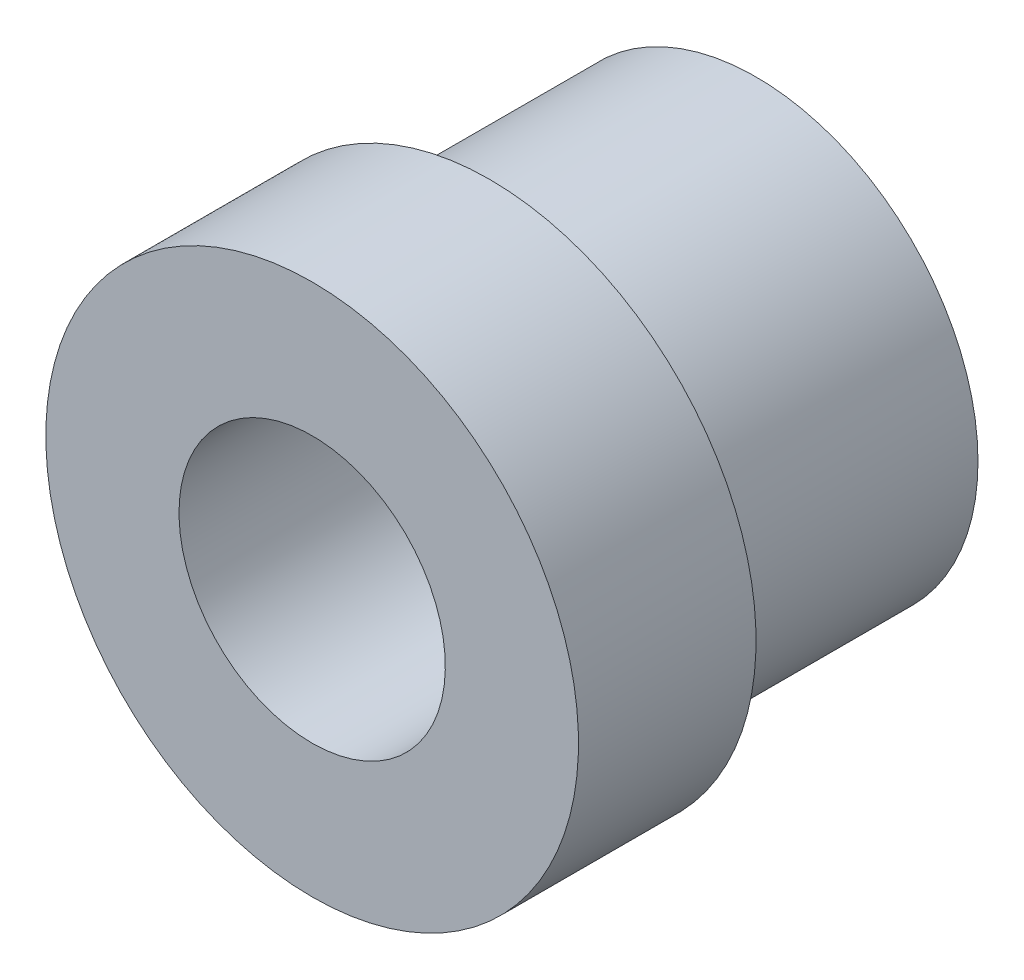
ISO-10303-21;
HEADER;
FILE_DESCRIPTION(('STEP AP214'),'2;1');
FILE_NAME('part.step','',(''),(''),'','','');
FILE_SCHEMA(('AUTOMOTIVE_DESIGN { 1 0 10303 214 1 1 1 1 }'));
ENDSEC;
DATA;
#1=APPLICATION_CONTEXT('core data for automotive mechanical design processes');
#2=APPLICATION_PROTOCOL_DEFINITION('international standard','automotive_design',2000,#1);
#3=PRODUCT_CONTEXT('',#1,'mechanical');
#4=PRODUCT('Part','Part','',(#3));
#5=PRODUCT_RELATED_PRODUCT_CATEGORY('part','',(#4));
#6=PRODUCT_DEFINITION_FORMATION('','',#4);
#7=PRODUCT_DEFINITION_CONTEXT('part definition',#1,'design');
#8=PRODUCT_DEFINITION('design','',#6,#7);
#9=PRODUCT_DEFINITION_SHAPE('','',#8);
#10=(LENGTH_UNIT() NAMED_UNIT(*) SI_UNIT(.MILLI.,.METRE.));
#11=(NAMED_UNIT(*) PLANE_ANGLE_UNIT() SI_UNIT($,.RADIAN.));
#12=(NAMED_UNIT(*) SI_UNIT($,.STERADIAN.) SOLID_ANGLE_UNIT());
#13=UNCERTAINTY_MEASURE_WITH_UNIT(LENGTH_MEASURE(1.E-05),#10,'distance_accuracy_value','');
#14=(GEOMETRIC_REPRESENTATION_CONTEXT(3) GLOBAL_UNCERTAINTY_ASSIGNED_CONTEXT((#13)) GLOBAL_UNIT_ASSIGNED_CONTEXT((#10,
#11,#12)) REPRESENTATION_CONTEXT('',''));
#15=CARTESIAN_POINT('',(0.,0.,0.));
#16=DIRECTION('',(0.,0.,1.));
#17=DIRECTION('',(1.,0.,0.));
#18=AXIS2_PLACEMENT_3D('',#15,#16,#17);
#19=CARTESIAN_POINT('',(0.,0.,-36.4449652892562));
#20=DIRECTION('',(0.,0.,-1.));
#21=DIRECTION('',(-1.,0.,0.));
#22=AXIS2_PLACEMENT_3D('',#19,#20,#21);
#23=CONICAL_SURFACE('',#22,7.5,0.785398163397448);
#24=CARTESIAN_POINT('',(0.,0.,-36.4449652892562));
#25=DIRECTION('',(0.,0.,1.));
#26=DIRECTION('',(0.,-1.,0.));
#27=AXIS2_PLACEMENT_3D('',#24,#25,#26);
#28=CIRCLE('',#27,7.5);
#29=CARTESIAN_POINT('',(0.,-7.5,-36.4449652892562));
#30=VERTEX_POINT('',#29);
#31=EDGE_CURVE('E30',#30,#30,#28,.F.);
#32=ORIENTED_EDGE('',*,*,#31,.F.);
#33=EDGE_LOOP('',(#32));
#34=FACE_BOUND('',#33,.T.);
#35=CARTESIAN_POINT('',(0.,0.,-35.4449652892562));
#36=DIRECTION('',(0.,0.,-1.));
#37=DIRECTION('',(-1.,0.,0.));
#38=AXIS2_PLACEMENT_3D('',#35,#36,#37);
#39=CIRCLE('',#38,6.5);
#40=CARTESIAN_POINT('',(-6.5,0.,-35.4449652892562));
#41=VERTEX_POINT('',#40);
#42=EDGE_CURVE('E18',#41,#41,#39,.T.);
#43=ORIENTED_EDGE('',*,*,#42,.T.);
#44=EDGE_LOOP('',(#43));
#45=FACE_BOUND('',#44,.T.);
#46=ADVANCED_FACE('F15',(#34,#45),#23,.T.);
#47=CARTESIAN_POINT('',(0.,9.,-35.4449652892562));
#48=DIRECTION('',(0.,0.,1.));
#49=DIRECTION('',(0.,-1.,0.));
#50=AXIS2_PLACEMENT_3D('',#47,#48,#49);
#51=PLANE('',#50);
#52=ORIENTED_EDGE('',*,*,#42,.F.);
#53=EDGE_LOOP('',(#52));
#54=FACE_BOUND('',#53,.T.);
#55=CARTESIAN_POINT('',(0.,0.,-35.4449652892562));
#56=DIRECTION('',(0.,0.,1.));
#57=DIRECTION('',(0.,-1.,0.));
#58=AXIS2_PLACEMENT_3D('',#55,#56,#57);
#59=CIRCLE('',#58,9.);
#60=CARTESIAN_POINT('',(0.,-9.,-35.4449652892562));
#61=VERTEX_POINT('',#60);
#62=EDGE_CURVE('E38',#61,#61,#59,.T.);
#63=ORIENTED_EDGE('',*,*,#62,.F.);
#64=EDGE_LOOP('',(#63));
#65=FACE_BOUND('',#64,.T.);
#66=ADVANCED_FACE('F50',(#54,#65),#51,.F.);
#67=CARTESIAN_POINT('',(0.,0.,-29.4449652892562));
#68=DIRECTION('',(0.,0.,1.));
#69=DIRECTION('',(0.,-1.,0.));
#70=AXIS2_PLACEMENT_3D('',#67,#68,#69);
#71=CYLINDRICAL_SURFACE('',#70,7.5);
#72=ORIENTED_EDGE('',*,*,#31,.T.);
#73=EDGE_LOOP('',(#72));
#74=FACE_BOUND('',#73,.T.);
#75=CARTESIAN_POINT('',(0.,0.,-44.4449652892729));
#76=DIRECTION('',(0.,0.,1.));
#77=DIRECTION('',(0.,-1.,0.));
#78=AXIS2_PLACEMENT_3D('',#75,#76,#77);
#79=CIRCLE('',#78,7.50000000005002);
#80=CARTESIAN_POINT('',(0.,-7.50000000005002,-44.4449652892729));
#81=VERTEX_POINT('',#80);
#82=EDGE_CURVE('E37',#81,#81,#79,.F.);
#83=ORIENTED_EDGE('',*,*,#82,.F.);
#84=EDGE_LOOP('',(#83));
#85=FACE_BOUND('',#84,.T.);
#86=ADVANCED_FACE('F53',(#74,#85),#71,.T.);
#87=CARTESIAN_POINT('',(0.,0.,-29.4449652892562));
#88=DIRECTION('',(0.,0.,1.));
#89=DIRECTION('',(0.,-1.,0.));
#90=AXIS2_PLACEMENT_3D('',#87,#88,#89);
#91=CYLINDRICAL_SURFACE('',#90,9.);
#92=CARTESIAN_POINT('',(0.,0.,-29.4449652892562));
#93=DIRECTION('',(0.,0.,1.));
#94=DIRECTION('',(0.,-1.,0.));
#95=AXIS2_PLACEMENT_3D('',#92,#93,#94);
#96=CIRCLE('',#95,9.);
#97=CARTESIAN_POINT('',(0.,-9.,-29.4449652892562));
#98=VERTEX_POINT('',#97);
#99=EDGE_CURVE('E35',#98,#98,#96,.F.);
#100=ORIENTED_EDGE('',*,*,#99,.T.);
#101=EDGE_LOOP('',(#100));
#102=FACE_BOUND('',#101,.T.);
#103=ORIENTED_EDGE('',*,*,#62,.T.);
#104=EDGE_LOOP('',(#103));
#105=FACE_BOUND('',#104,.T.);
#106=ADVANCED_FACE('F59',(#102,#105),#91,.T.);
#107=CARTESIAN_POINT('',(0.,0.,-44.4449652892729));
#108=DIRECTION('',(0.,0.,1.));
#109=DIRECTION('',(1.,0.,0.));
#110=AXIS2_PLACEMENT_3D('',#107,#108,#109);
#111=CONICAL_SURFACE('',#110,7.50000000005002,1.21449651636134);
#112=ORIENTED_EDGE('',*,*,#82,.T.);
#113=EDGE_LOOP('',(#112));
#114=FACE_BOUND('',#113,.T.);
#115=CARTESIAN_POINT('',(0.,0.,-45.4449652892777));
#116=DIRECTION('',(0.,0.,1.));
#117=DIRECTION('',(1.,0.,0.));
#118=AXIS2_PLACEMENT_3D('',#115,#116,#117);
#119=CIRCLE('',#118,4.81315894541012);
#120=CARTESIAN_POINT('',(4.81315894541012,0.,-45.4449652892777));
#121=VERTEX_POINT('',#120);
#122=EDGE_CURVE('E27',#121,#121,#119,.T.);
#123=ORIENTED_EDGE('',*,*,#122,.T.);
#124=EDGE_LOOP('',(#123));
#125=FACE_BOUND('',#124,.T.);
#126=ADVANCED_FACE('F77',(#114,#125),#111,.T.);
#127=CARTESIAN_POINT('',(0.,4.5,-29.4449652892562));
#128=DIRECTION('',(0.,0.,-1.));
#129=DIRECTION('',(0.,1.,0.));
#130=AXIS2_PLACEMENT_3D('',#127,#128,#129);
#131=PLANE('',#130);
#132=ORIENTED_EDGE('',*,*,#99,.F.);
#133=EDGE_LOOP('',(#132));
#134=FACE_BOUND('',#133,.T.);
#135=CARTESIAN_POINT('',(0.,0.,-29.4449652892562));
#136=DIRECTION('',(0.,0.,1.));
#137=DIRECTION('',(0.,-1.,0.));
#138=AXIS2_PLACEMENT_3D('',#135,#136,#137);
#139=CIRCLE('',#138,4.5);
#140=CARTESIAN_POINT('',(0.,-4.5,-29.4449652892562));
#141=VERTEX_POINT('',#140);
#142=EDGE_CURVE('E22',#141,#141,#139,.F.);
#143=ORIENTED_EDGE('',*,*,#142,.T.);
#144=EDGE_LOOP('',(#143));
#145=FACE_BOUND('',#144,.T.);
#146=ADVANCED_FACE('F70',(#134,#145),#131,.F.);
#147=CARTESIAN_POINT('',(0.,4.8131589454171,-45.4449652892562));
#148=DIRECTION('',(0.,0.,1.));
#149=DIRECTION('',(0.,-1.,0.));
#150=AXIS2_PLACEMENT_3D('',#147,#148,#149);
#151=PLANE('',#150);
#152=CARTESIAN_POINT('',(0.,0.,-45.4449652892562));
#153=DIRECTION('',(0.,0.,1.));
#154=DIRECTION('',(0.,-1.,0.));
#155=AXIS2_PLACEMENT_3D('',#152,#153,#154);
#156=CIRCLE('',#155,4.5);
#157=CARTESIAN_POINT('',(0.,-4.5,-45.4449652892562));
#158=VERTEX_POINT('',#157);
#159=EDGE_CURVE('E10',#158,#158,#156,.T.);
#160=ORIENTED_EDGE('',*,*,#159,.T.);
#161=EDGE_LOOP('',(#160));
#162=FACE_BOUND('',#161,.T.);
#163=ORIENTED_EDGE('',*,*,#122,.F.);
#164=EDGE_LOOP('',(#163));
#165=FACE_BOUND('',#164,.T.);
#166=ADVANCED_FACE('F64',(#162,#165),#151,.F.);
#167=CARTESIAN_POINT('',(0.,0.,-29.4449652892562));
#168=DIRECTION('',(0.,0.,1.));
#169=DIRECTION('',(0.,-1.,0.));
#170=AXIS2_PLACEMENT_3D('',#167,#168,#169);
#171=CYLINDRICAL_SURFACE('',#170,4.5);
#172=ORIENTED_EDGE('',*,*,#142,.F.);
#173=EDGE_LOOP('',(#172));
#174=FACE_BOUND('',#173,.T.);
#175=ORIENTED_EDGE('',*,*,#159,.F.);
#176=EDGE_LOOP('',(#175));
#177=FACE_BOUND('',#176,.T.);
#178=ADVANCED_FACE('F62',(#174,#177),#171,.F.);
#179=CLOSED_SHELL('',(#46,#66,#86,#106,#126,#146,#166,#178));
#180=MANIFOLD_SOLID_BREP('B1',#179);
#181=ADVANCED_BREP_SHAPE_REPRESENTATION('',(#18,#180),#14);
#182=SHAPE_DEFINITION_REPRESENTATION(#9,#181);
ENDSEC;
END-ISO-10303-21;
